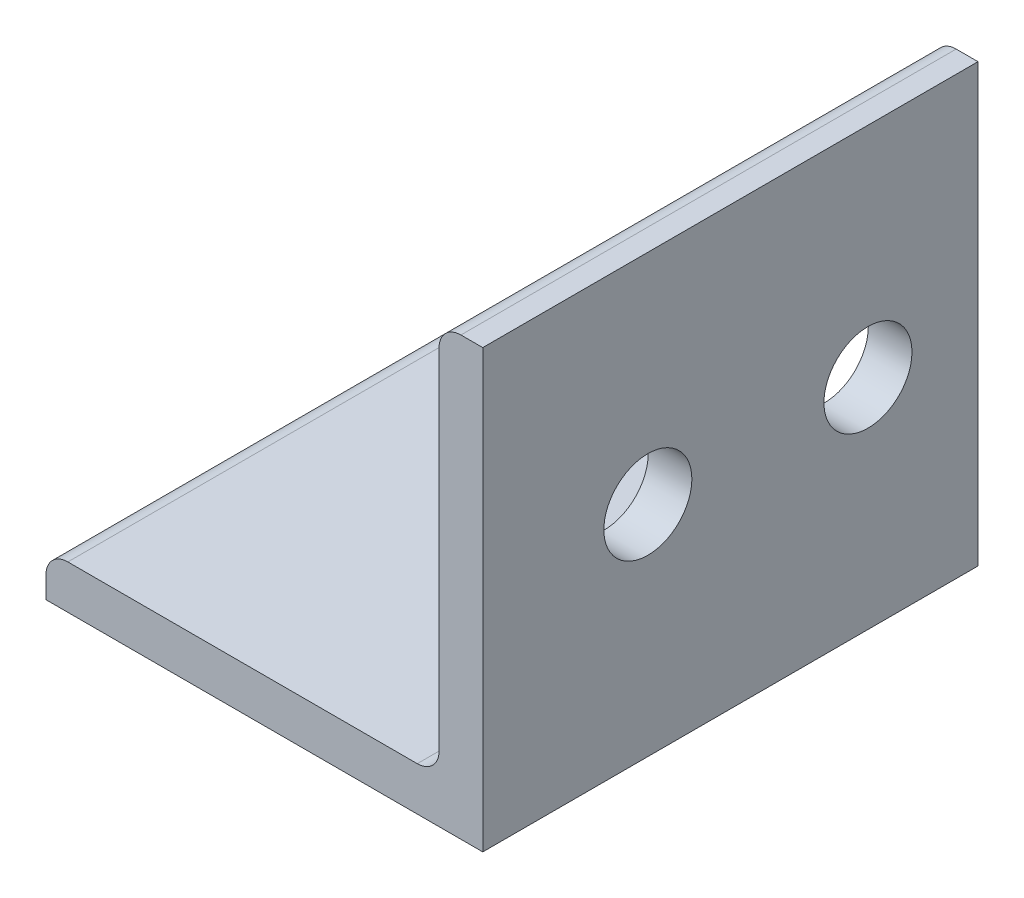
ISO-10303-21;
HEADER;
FILE_DESCRIPTION(('STEP AP214'),'2;1');
FILE_NAME('part.step','',(''),(''),'','','');
FILE_SCHEMA(('AUTOMOTIVE_DESIGN { 1 0 10303 214 1 1 1 1 }'));
ENDSEC;
DATA;
#1=APPLICATION_CONTEXT('core data for automotive mechanical design processes');
#2=APPLICATION_PROTOCOL_DEFINITION('international standard','automotive_design',2000,#1);
#3=PRODUCT_CONTEXT('',#1,'mechanical');
#4=PRODUCT('Part','Part','',(#3));
#5=PRODUCT_RELATED_PRODUCT_CATEGORY('part','',(#4));
#6=PRODUCT_DEFINITION_FORMATION('','',#4);
#7=PRODUCT_DEFINITION_CONTEXT('part definition',#1,'design');
#8=PRODUCT_DEFINITION('design','',#6,#7);
#9=PRODUCT_DEFINITION_SHAPE('','',#8);
#10=(LENGTH_UNIT() NAMED_UNIT(*) SI_UNIT(.MILLI.,.METRE.));
#11=(NAMED_UNIT(*) PLANE_ANGLE_UNIT() SI_UNIT($,.RADIAN.));
#12=(NAMED_UNIT(*) SI_UNIT($,.STERADIAN.) SOLID_ANGLE_UNIT());
#13=UNCERTAINTY_MEASURE_WITH_UNIT(LENGTH_MEASURE(1.E-05),#10,'distance_accuracy_value','');
#14=(GEOMETRIC_REPRESENTATION_CONTEXT(3) GLOBAL_UNCERTAINTY_ASSIGNED_CONTEXT((#13)) GLOBAL_UNIT_ASSIGNED_CONTEXT((#10,
#11,#12)) REPRESENTATION_CONTEXT('',''));
#15=CARTESIAN_POINT('',(0.,0.,0.));
#16=DIRECTION('',(0.,0.,1.));
#17=DIRECTION('',(1.,0.,0.));
#18=AXIS2_PLACEMENT_3D('',#15,#16,#17);
#19=CARTESIAN_POINT('',(-7.9375,0.793749999999998,152.4));
#20=DIRECTION('',(1.,0.,0.));
#21=DIRECTION('',(0.,0.,-1.));
#22=AXIS2_PLACEMENT_3D('',#19,#20,#21);
#23=PLANE('',#22);
#24=DIRECTION('',(0.,-1.,0.));
#25=VECTOR('',#24,1.);
#26=CARTESIAN_POINT('',(-7.9375,0.793749999999999,-134.4));
#27=LINE('',#26,#25);
#28=CARTESIAN_POINT('',(-7.9375,0.793749999999999,-134.4));
#29=VERTEX_POINT('',#28);
#30=CARTESIAN_POINT('',(-7.9375,0.,-134.4));
#31=VERTEX_POINT('',#30);
#32=EDGE_CURVE('E106',#29,#31,#27,.T.);
#33=ORIENTED_EDGE('',*,*,#32,.F.);
#34=DIRECTION('',(0.,0.,-1.));
#35=VECTOR('',#34,1.);
#36=CARTESIAN_POINT('',(-7.9375,0.793749999999999,152.4));
#37=LINE('',#36,#35);
#38=CARTESIAN_POINT('',(-7.9375,0.793749999999999,-152.4));
#39=VERTEX_POINT('',#38);
#40=EDGE_CURVE('E58',#29,#39,#37,.T.);
#41=ORIENTED_EDGE('',*,*,#40,.T.);
#42=DIRECTION('',(0.,-1.,0.));
#43=VECTOR('',#42,1.);
#44=CARTESIAN_POINT('',(-7.9375,0.793749999999998,-152.4));
#45=LINE('',#44,#43);
#46=CARTESIAN_POINT('',(-7.9375,0.,-152.4));
#47=VERTEX_POINT('',#46);
#48=EDGE_CURVE('E151',#39,#47,#45,.T.);
#49=ORIENTED_EDGE('',*,*,#48,.T.);
#50=DIRECTION('',(0.,0.,-1.));
#51=VECTOR('',#50,1.);
#52=CARTESIAN_POINT('',(-7.9375,0.,152.4));
#53=LINE('',#52,#51);
#54=EDGE_CURVE('E11',#31,#47,#53,.T.);
#55=ORIENTED_EDGE('',*,*,#54,.F.);
#56=EDGE_LOOP('',(#33,#41,#49,#55));
#57=FACE_BOUND('',#56,.T.);
#58=ADVANCED_FACE('F36',(#57),#23,.F.);
#59=CARTESIAN_POINT('',(-7.9375,0.,152.4));
#60=DIRECTION('',(0.,1.,0.));
#61=DIRECTION('',(0.,0.,1.));
#62=AXIS2_PLACEMENT_3D('',#59,#60,#61);
#63=PLANE('',#62);
#64=CARTESIAN_POINT('',(0.,0.,-143.4));
#65=DIRECTION('',(0.,-1.,0.));
#66=DIRECTION('',(0.,0.,-1.));
#67=AXIS2_PLACEMENT_3D('',#64,#65,#66);
#68=CIRCLE('',#67,1.5875);
#69=CARTESIAN_POINT('',(0.,0.,-144.9875));
#70=VERTEX_POINT('',#69);
#71=EDGE_CURVE('E201',#70,#70,#68,.T.);
#72=ORIENTED_EDGE('',*,*,#71,.F.);
#73=EDGE_LOOP('',(#72));
#74=FACE_BOUND('',#73,.T.);
#75=DIRECTION('',(1.,0.,0.));
#76=VECTOR('',#75,1.);
#77=CARTESIAN_POINT('',(-7.9375,0.,-134.4));
#78=LINE('',#77,#76);
#79=CARTESIAN_POINT('',(7.9375,0.,-134.4));
#80=VERTEX_POINT('',#79);
#81=EDGE_CURVE('E113',#31,#80,#78,.T.);
#82=ORIENTED_EDGE('',*,*,#81,.F.);
#83=ORIENTED_EDGE('',*,*,#54,.T.);
#84=DIRECTION('',(1.,0.,0.));
#85=VECTOR('',#84,1.);
#86=CARTESIAN_POINT('',(-7.9375,0.,-152.4));
#87=LINE('',#86,#85);
#88=CARTESIAN_POINT('',(7.9375,0.,-152.4));
#89=VERTEX_POINT('',#88);
#90=EDGE_CURVE('E148',#47,#89,#87,.T.);
#91=ORIENTED_EDGE('',*,*,#90,.T.);
#92=DIRECTION('',(0.,0.,-1.));
#93=VECTOR('',#92,1.);
#94=CARTESIAN_POINT('',(7.9375,0.,152.4));
#95=LINE('',#94,#93);
#96=EDGE_CURVE('E43',#80,#89,#95,.T.);
#97=ORIENTED_EDGE('',*,*,#96,.F.);
#98=EDGE_LOOP('',(#82,#83,#91,#97));
#99=FACE_BOUND('',#98,.T.);
#100=ADVANCED_FACE('F149',(#74,#99),#63,.F.);
#101=CARTESIAN_POINT('',(7.9375,0.,152.4));
#102=DIRECTION('',(-1.,0.,0.));
#103=DIRECTION('',(0.,0.,1.));
#104=AXIS2_PLACEMENT_3D('',#101,#102,#103);
#105=PLANE('',#104);
#106=CARTESIAN_POINT('',(7.9375,7.93749999999998,-140.4));
#107=DIRECTION('',(1.,0.,0.));
#108=DIRECTION('',(0.,0.,-1.));
#109=AXIS2_PLACEMENT_3D('',#106,#107,#108);
#110=CIRCLE('',#109,1.59999999999991);
#111=CARTESIAN_POINT('',(7.9375,7.93749999999998,-142.));
#112=VERTEX_POINT('',#111);
#113=EDGE_CURVE('E183',#112,#112,#110,.T.);
#114=ORIENTED_EDGE('',*,*,#113,.F.);
#115=EDGE_LOOP('',(#114));
#116=FACE_BOUND('',#115,.T.);
#117=CARTESIAN_POINT('',(7.9375,7.93749999999998,-148.4));
#118=DIRECTION('',(1.,0.,0.));
#119=DIRECTION('',(0.,0.,-1.));
#120=AXIS2_PLACEMENT_3D('',#117,#118,#119);
#121=CIRCLE('',#120,1.59999999999991);
#122=CARTESIAN_POINT('',(7.9375,7.93749999999998,-150.));
#123=VERTEX_POINT('',#122);
#124=EDGE_CURVE('E177',#123,#123,#121,.T.);
#125=ORIENTED_EDGE('',*,*,#124,.F.);
#126=EDGE_LOOP('',(#125));
#127=FACE_BOUND('',#126,.T.);
#128=DIRECTION('',(0.,1.,0.));
#129=VECTOR('',#128,1.);
#130=CARTESIAN_POINT('',(7.9375,0.,-134.4));
#131=LINE('',#130,#129);
#132=CARTESIAN_POINT('',(7.9375,15.875,-134.4));
#133=VERTEX_POINT('',#132);
#134=EDGE_CURVE('E145',#80,#133,#131,.T.);
#135=ORIENTED_EDGE('',*,*,#134,.F.);
#136=ORIENTED_EDGE('',*,*,#96,.T.);
#137=DIRECTION('',(0.,1.,0.));
#138=VECTOR('',#137,1.);
#139=CARTESIAN_POINT('',(7.9375,0.,-152.4));
#140=LINE('',#139,#138);
#141=CARTESIAN_POINT('',(7.9375,15.875,-152.4));
#142=VERTEX_POINT('',#141);
#143=EDGE_CURVE('E143',#89,#142,#140,.T.);
#144=ORIENTED_EDGE('',*,*,#143,.T.);
#145=DIRECTION('',(0.,0.,-1.));
#146=VECTOR('',#145,1.);
#147=CARTESIAN_POINT('',(7.9375,15.875,152.4));
#148=LINE('',#147,#146);
#149=EDGE_CURVE('E134',#133,#142,#148,.T.);
#150=ORIENTED_EDGE('',*,*,#149,.F.);
#151=EDGE_LOOP('',(#135,#136,#144,#150));
#152=FACE_BOUND('',#151,.T.);
#153=ADVANCED_FACE('F140',(#116,#127,#152),#105,.F.);
#154=CARTESIAN_POINT('',(7.14375,15.875,152.4));
#155=DIRECTION('',(0.,-1.,0.));
#156=DIRECTION('',(1.,0.,0.));
#157=AXIS2_PLACEMENT_3D('',#154,#155,#156);
#158=PLANE('',#157);
#159=DIRECTION('',(-1.,0.,0.));
#160=VECTOR('',#159,1.);
#161=CARTESIAN_POINT('',(7.9375,15.875,-134.4));
#162=LINE('',#161,#160);
#163=CARTESIAN_POINT('',(7.14375,15.875,-134.4));
#164=VERTEX_POINT('',#163);
#165=EDGE_CURVE('E195',#133,#164,#162,.T.);
#166=ORIENTED_EDGE('',*,*,#165,.F.);
#167=ORIENTED_EDGE('',*,*,#149,.T.);
#168=DIRECTION('',(-1.,0.,0.));
#169=VECTOR('',#168,1.);
#170=CARTESIAN_POINT('',(7.14375,15.875,-152.4));
#171=LINE('',#170,#169);
#172=CARTESIAN_POINT('',(7.14375,15.875,-152.4));
#173=VERTEX_POINT('',#172);
#174=EDGE_CURVE('E156',#142,#173,#171,.T.);
#175=ORIENTED_EDGE('',*,*,#174,.T.);
#176=DIRECTION('',(0.,0.,-1.));
#177=VECTOR('',#176,1.);
#178=CARTESIAN_POINT('',(7.14375,15.875,152.4));
#179=LINE('',#178,#177);
#180=EDGE_CURVE('E132',#164,#173,#179,.T.);
#181=ORIENTED_EDGE('',*,*,#180,.F.);
#182=EDGE_LOOP('',(#166,#167,#175,#181));
#183=FACE_BOUND('',#182,.T.);
#184=ADVANCED_FACE('F213',(#183),#158,.F.);
#185=CARTESIAN_POINT('',(7.14375,15.08125,152.4));
#186=DIRECTION('',(0.,0.,-1.));
#187=DIRECTION('',(-1.,0.,0.));
#188=AXIS2_PLACEMENT_3D('',#185,#186,#187);
#189=CYLINDRICAL_SURFACE('',#188,0.793749999999998);
#190=CARTESIAN_POINT('',(7.14375,15.08125,-134.4));
#191=DIRECTION('',(0.,0.,1.));
#192=DIRECTION('',(1.,0.,0.));
#193=AXIS2_PLACEMENT_3D('',#190,#191,#192);
#194=CIRCLE('',#193,0.793749999999999);
#195=CARTESIAN_POINT('',(6.35,15.08125,-134.4));
#196=VERTEX_POINT('',#195);
#197=EDGE_CURVE('E193',#164,#196,#194,.T.);
#198=ORIENTED_EDGE('',*,*,#197,.F.);
#199=ORIENTED_EDGE('',*,*,#180,.T.);
#200=CARTESIAN_POINT('',(7.14375,15.08125,-152.4));
#201=DIRECTION('',(0.,0.,1.));
#202=DIRECTION('',(-1.,0.,0.));
#203=AXIS2_PLACEMENT_3D('',#200,#201,#202);
#204=CIRCLE('',#203,0.793749999999998);
#205=CARTESIAN_POINT('',(6.35,15.08125,-152.4));
#206=VERTEX_POINT('',#205);
#207=EDGE_CURVE('E158',#173,#206,#204,.T.);
#208=ORIENTED_EDGE('',*,*,#207,.T.);
#209=DIRECTION('',(0.,0.,-1.));
#210=VECTOR('',#209,1.);
#211=CARTESIAN_POINT('',(6.35,15.08125,152.4));
#212=LINE('',#211,#210);
#213=EDGE_CURVE('E130',#196,#206,#212,.T.);
#214=ORIENTED_EDGE('',*,*,#213,.F.);
#215=EDGE_LOOP('',(#198,#199,#208,#214));
#216=FACE_BOUND('',#215,.T.);
#217=ADVANCED_FACE('F219',(#216),#189,.T.);
#218=CARTESIAN_POINT('',(6.35,15.08125,152.4));
#219=DIRECTION('',(1.,0.,0.));
#220=DIRECTION('',(0.,1.,0.));
#221=AXIS2_PLACEMENT_3D('',#218,#219,#220);
#222=PLANE('',#221);
#223=CARTESIAN_POINT('',(6.35,7.93749999999998,-140.4));
#224=DIRECTION('',(1.,0.,0.));
#225=DIRECTION('',(0.,1.,0.));
#226=AXIS2_PLACEMENT_3D('',#223,#224,#225);
#227=CIRCLE('',#226,1.59999999999991);
#228=CARTESIAN_POINT('',(6.35,9.53749999999988,-140.4));
#229=VERTEX_POINT('',#228);
#230=EDGE_CURVE('E180',#229,#229,#227,.F.);
#231=ORIENTED_EDGE('',*,*,#230,.F.);
#232=EDGE_LOOP('',(#231));
#233=FACE_BOUND('',#232,.T.);
#234=CARTESIAN_POINT('',(6.35,7.93749999999998,-148.4));
#235=DIRECTION('',(1.,0.,0.));
#236=DIRECTION('',(0.,1.,0.));
#237=AXIS2_PLACEMENT_3D('',#234,#235,#236);
#238=CIRCLE('',#237,1.59999999999991);
#239=CARTESIAN_POINT('',(6.35,9.53749999999988,-148.4));
#240=VERTEX_POINT('',#239);
#241=EDGE_CURVE('E175',#240,#240,#238,.F.);
#242=ORIENTED_EDGE('',*,*,#241,.F.);
#243=EDGE_LOOP('',(#242));
#244=FACE_BOUND('',#243,.T.);
#245=DIRECTION('',(0.,-1.,0.));
#246=VECTOR('',#245,1.);
#247=CARTESIAN_POINT('',(6.35,15.08125,-134.4));
#248=LINE('',#247,#246);
#249=CARTESIAN_POINT('',(6.35,2.38124999999999,-134.4));
#250=VERTEX_POINT('',#249);
#251=EDGE_CURVE('E191',#196,#250,#248,.T.);
#252=ORIENTED_EDGE('',*,*,#251,.F.);
#253=ORIENTED_EDGE('',*,*,#213,.T.);
#254=DIRECTION('',(0.,-1.,0.));
#255=VECTOR('',#254,1.);
#256=CARTESIAN_POINT('',(6.35,15.08125,-152.4));
#257=LINE('',#256,#255);
#258=CARTESIAN_POINT('',(6.35,2.38124999999999,-152.4));
#259=VERTEX_POINT('',#258);
#260=EDGE_CURVE('E164',#206,#259,#257,.T.);
#261=ORIENTED_EDGE('',*,*,#260,.T.);
#262=DIRECTION('',(0.,0.,-1.));
#263=VECTOR('',#262,1.);
#264=CARTESIAN_POINT('',(6.35,2.38124999999999,152.4));
#265=LINE('',#264,#263);
#266=EDGE_CURVE('E128',#250,#259,#265,.T.);
#267=ORIENTED_EDGE('',*,*,#266,.F.);
#268=EDGE_LOOP('',(#252,#253,#261,#267));
#269=FACE_BOUND('',#268,.T.);
#270=ADVANCED_FACE('F223',(#233,#244,#269),#222,.F.);
#271=CARTESIAN_POINT('',(5.55625000000001,2.38124999999999,152.4));
#272=DIRECTION('',(0.,0.,-1.));
#273=DIRECTION('',(-1.,0.,0.));
#274=AXIS2_PLACEMENT_3D('',#271,#272,#273);
#275=CYLINDRICAL_SURFACE('',#274,0.793749999999998);
#276=CARTESIAN_POINT('',(5.55625000000001,2.38124999999999,-134.4));
#277=DIRECTION('',(0.,0.,-1.));
#278=DIRECTION('',(1.,0.,0.));
#279=AXIS2_PLACEMENT_3D('',#276,#277,#278);
#280=CIRCLE('',#279,0.793749999999999);
#281=CARTESIAN_POINT('',(5.55625000000001,1.5875,-134.4));
#282=VERTEX_POINT('',#281);
#283=EDGE_CURVE('E189',#250,#282,#280,.T.);
#284=ORIENTED_EDGE('',*,*,#283,.F.);
#285=ORIENTED_EDGE('',*,*,#266,.T.);
#286=CARTESIAN_POINT('',(5.55625000000001,2.38124999999999,-152.4));
#287=DIRECTION('',(0.,0.,-1.));
#288=DIRECTION('',(-1.,0.,0.));
#289=AXIS2_PLACEMENT_3D('',#286,#287,#288);
#290=CIRCLE('',#289,0.793749999999998);
#291=CARTESIAN_POINT('',(5.55625000000001,1.5875,-152.4));
#292=VERTEX_POINT('',#291);
#293=EDGE_CURVE('E167',#259,#292,#290,.T.);
#294=ORIENTED_EDGE('',*,*,#293,.T.);
#295=DIRECTION('',(0.,0.,-1.));
#296=VECTOR('',#295,1.);
#297=CARTESIAN_POINT('',(5.55625000000001,1.5875,152.4));
#298=LINE('',#297,#296);
#299=EDGE_CURVE('E121',#282,#292,#298,.T.);
#300=ORIENTED_EDGE('',*,*,#299,.F.);
#301=EDGE_LOOP('',(#284,#285,#294,#300));
#302=FACE_BOUND('',#301,.T.);
#303=ADVANCED_FACE('F227',(#302),#275,.F.);
#304=CARTESIAN_POINT('',(5.55625000000001,1.5875,152.4));
#305=DIRECTION('',(0.,-1.,0.));
#306=DIRECTION('',(1.,0.,0.));
#307=AXIS2_PLACEMENT_3D('',#304,#305,#306);
#308=PLANE('',#307);
#309=CARTESIAN_POINT('',(0.,1.5875,-143.4));
#310=DIRECTION('',(0.,-1.,0.));
#311=DIRECTION('',(1.,0.,0.));
#312=AXIS2_PLACEMENT_3D('',#309,#310,#311);
#313=CIRCLE('',#312,1.5875);
#314=CARTESIAN_POINT('',(1.5875,1.5875,-143.4));
#315=VERTEX_POINT('',#314);
#316=EDGE_CURVE('E110',#315,#315,#313,.F.);
#317=ORIENTED_EDGE('',*,*,#316,.F.);
#318=EDGE_LOOP('',(#317));
#319=FACE_BOUND('',#318,.T.);
#320=DIRECTION('',(-1.,0.,0.));
#321=VECTOR('',#320,1.);
#322=CARTESIAN_POINT('',(5.55625000000001,1.5875,-134.4));
#323=LINE('',#322,#321);
#324=CARTESIAN_POINT('',(-7.14375,1.5875,-134.4));
#325=VERTEX_POINT('',#324);
#326=EDGE_CURVE('E50',#282,#325,#323,.T.);
#327=ORIENTED_EDGE('',*,*,#326,.F.);
#328=ORIENTED_EDGE('',*,*,#299,.T.);
#329=DIRECTION('',(-1.,0.,0.));
#330=VECTOR('',#329,1.);
#331=CARTESIAN_POINT('',(5.55625000000001,1.5875,-152.4));
#332=LINE('',#331,#330);
#333=CARTESIAN_POINT('',(-7.14375,1.5875,-152.4));
#334=VERTEX_POINT('',#333);
#335=EDGE_CURVE('E123',#292,#334,#332,.T.);
#336=ORIENTED_EDGE('',*,*,#335,.T.);
#337=DIRECTION('',(0.,0.,-1.));
#338=VECTOR('',#337,1.);
#339=CARTESIAN_POINT('',(-7.14375,1.5875,152.4));
#340=LINE('',#339,#338);
#341=EDGE_CURVE('E119',#325,#334,#340,.T.);
#342=ORIENTED_EDGE('',*,*,#341,.F.);
#343=EDGE_LOOP('',(#327,#328,#336,#342));
#344=FACE_BOUND('',#343,.T.);
#345=ADVANCED_FACE('F172',(#319,#344),#308,.F.);
#346=CARTESIAN_POINT('',(-7.14375,0.793749999999999,152.4));
#347=DIRECTION('',(0.,0.,-1.));
#348=DIRECTION('',(-1.,0.,0.));
#349=AXIS2_PLACEMENT_3D('',#346,#347,#348);
#350=CYLINDRICAL_SURFACE('',#349,0.793749999999999);
#351=CARTESIAN_POINT('',(-7.14375,0.793749999999999,-134.4));
#352=DIRECTION('',(0.,0.,1.));
#353=DIRECTION('',(1.,0.,0.));
#354=AXIS2_PLACEMENT_3D('',#351,#352,#353);
#355=CIRCLE('',#354,0.793749999999999);
#356=EDGE_CURVE('E104',#325,#29,#355,.T.);
#357=ORIENTED_EDGE('',*,*,#356,.F.);
#358=ORIENTED_EDGE('',*,*,#341,.T.);
#359=CARTESIAN_POINT('',(-7.14375,0.793749999999999,-152.4));
#360=DIRECTION('',(0.,0.,1.));
#361=DIRECTION('',(-1.,0.,0.));
#362=AXIS2_PLACEMENT_3D('',#359,#360,#361);
#363=CIRCLE('',#362,0.793749999999999);
#364=EDGE_CURVE('E117',#334,#39,#363,.T.);
#365=ORIENTED_EDGE('',*,*,#364,.T.);
#366=ORIENTED_EDGE('',*,*,#40,.F.);
#367=EDGE_LOOP('',(#357,#358,#365,#366));
#368=FACE_BOUND('',#367,.T.);
#369=ADVANCED_FACE('F115',(#368),#350,.T.);
#370=CARTESIAN_POINT('',(7.14375,15.08125,-152.4));
#371=DIRECTION('',(0.,0.,-1.));
#372=DIRECTION('',(-1.,0.,0.));
#373=AXIS2_PLACEMENT_3D('',#370,#371,#372);
#374=PLANE('',#373);
#375=ORIENTED_EDGE('',*,*,#48,.F.);
#376=ORIENTED_EDGE('',*,*,#364,.F.);
#377=ORIENTED_EDGE('',*,*,#335,.F.);
#378=ORIENTED_EDGE('',*,*,#293,.F.);
#379=ORIENTED_EDGE('',*,*,#260,.F.);
#380=ORIENTED_EDGE('',*,*,#207,.F.);
#381=ORIENTED_EDGE('',*,*,#174,.F.);
#382=ORIENTED_EDGE('',*,*,#143,.F.);
#383=ORIENTED_EDGE('',*,*,#90,.F.);
#384=EDGE_LOOP('',(#375,#376,#377,#378,#379,#380,#381,#382,#383));
#385=FACE_BOUND('',#384,.T.);
#386=ADVANCED_FACE('F153',(#385),#374,.T.);
#387=CARTESIAN_POINT('',(-7.9385,7.93749999999998,-140.4));
#388=DIRECTION('',(1.,0.,0.));
#389=DIRECTION('',(0.,0.,-1.));
#390=AXIS2_PLACEMENT_3D('',#387,#388,#389);
#391=CYLINDRICAL_SURFACE('',#390,1.59999999999991);
#392=ORIENTED_EDGE('',*,*,#113,.T.);
#393=EDGE_LOOP('',(#392));
#394=FACE_BOUND('',#393,.T.);
#395=ORIENTED_EDGE('',*,*,#230,.T.);
#396=EDGE_LOOP('',(#395));
#397=FACE_BOUND('',#396,.T.);
#398=ADVANCED_FACE('F239',(#394,#397),#391,.F.);
#399=CARTESIAN_POINT('',(-7.9385,7.93749999999998,-148.4));
#400=DIRECTION('',(1.,0.,0.));
#401=DIRECTION('',(0.,0.,-1.));
#402=AXIS2_PLACEMENT_3D('',#399,#400,#401);
#403=CYLINDRICAL_SURFACE('',#402,1.59999999999991);
#404=ORIENTED_EDGE('',*,*,#124,.T.);
#405=EDGE_LOOP('',(#404));
#406=FACE_BOUND('',#405,.T.);
#407=ORIENTED_EDGE('',*,*,#241,.T.);
#408=EDGE_LOOP('',(#407));
#409=FACE_BOUND('',#408,.T.);
#410=ADVANCED_FACE('F242',(#406,#409),#403,.F.);
#411=CARTESIAN_POINT('',(-7.14375,0.793749999999999,-134.4));
#412=DIRECTION('',(0.,0.,1.));
#413=DIRECTION('',(1.,0.,0.));
#414=AXIS2_PLACEMENT_3D('',#411,#412,#413);
#415=PLANE('',#414);
#416=ORIENTED_EDGE('',*,*,#356,.T.);
#417=ORIENTED_EDGE('',*,*,#32,.T.);
#418=ORIENTED_EDGE('',*,*,#81,.T.);
#419=ORIENTED_EDGE('',*,*,#134,.T.);
#420=ORIENTED_EDGE('',*,*,#165,.T.);
#421=ORIENTED_EDGE('',*,*,#197,.T.);
#422=ORIENTED_EDGE('',*,*,#251,.T.);
#423=ORIENTED_EDGE('',*,*,#283,.T.);
#424=ORIENTED_EDGE('',*,*,#326,.T.);
#425=EDGE_LOOP('',(#416,#417,#418,#419,#420,#421,#422,#423,#424));
#426=FACE_BOUND('',#425,.T.);
#427=ADVANCED_FACE('F105',(#426),#415,.T.);
#428=CARTESIAN_POINT('',(0.,15.876,-143.4));
#429=DIRECTION('',(0.,-1.,0.));
#430=DIRECTION('',(0.,0.,-1.));
#431=AXIS2_PLACEMENT_3D('',#428,#429,#430);
#432=CYLINDRICAL_SURFACE('',#431,1.5875);
#433=ORIENTED_EDGE('',*,*,#71,.T.);
#434=EDGE_LOOP('',(#433));
#435=FACE_BOUND('',#434,.T.);
#436=ORIENTED_EDGE('',*,*,#316,.T.);
#437=EDGE_LOOP('',(#436));
#438=FACE_BOUND('',#437,.T.);
#439=ADVANCED_FACE('F205',(#435,#438),#432,.F.);
#440=CLOSED_SHELL('',(#58,#100,#153,#184,#217,#270,#303,#345,#369,#386,#398,#410,#427,#439));
#441=MANIFOLD_SOLID_BREP('B2',#440);
#442=ADVANCED_BREP_SHAPE_REPRESENTATION('',(#18,#441),#14);
#443=SHAPE_DEFINITION_REPRESENTATION(#9,#442);
ENDSEC;
END-ISO-10303-21;
